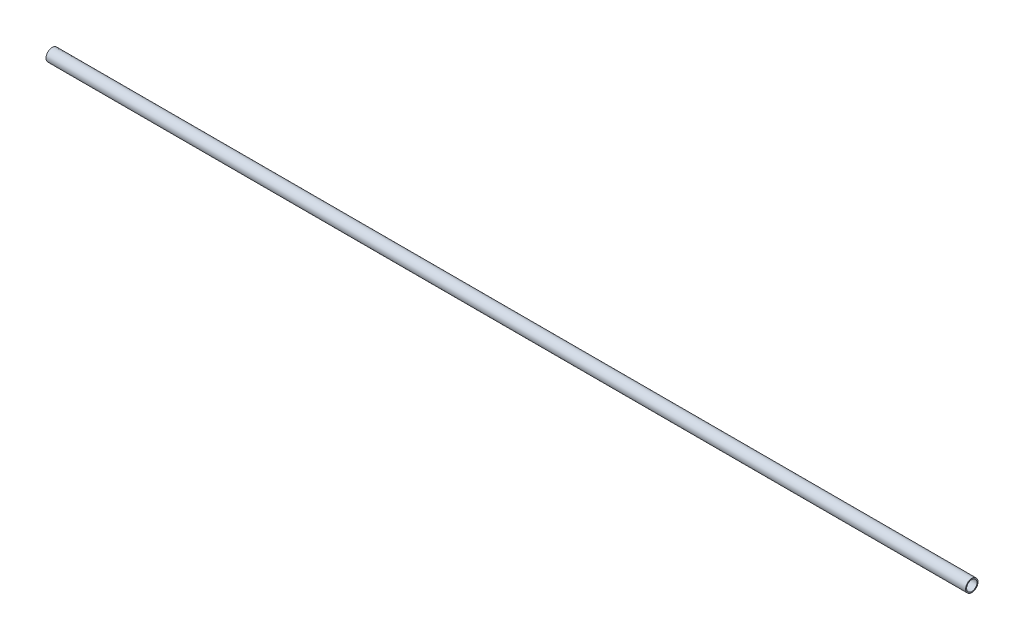
ISO-10303-21;
HEADER;
FILE_DESCRIPTION(('STEP AP214'),'2;1');
FILE_NAME('part.step','',(''),(''),'','','');
FILE_SCHEMA(('AUTOMOTIVE_DESIGN { 1 0 10303 214 1 1 1 1 }'));
ENDSEC;
DATA;
#1=APPLICATION_CONTEXT('core data for automotive mechanical design processes');
#2=APPLICATION_PROTOCOL_DEFINITION('international standard','automotive_design',2000,#1);
#3=PRODUCT_CONTEXT('',#1,'mechanical');
#4=PRODUCT('Part','Part','',(#3));
#5=PRODUCT_RELATED_PRODUCT_CATEGORY('part','',(#4));
#6=PRODUCT_DEFINITION_FORMATION('','',#4);
#7=PRODUCT_DEFINITION_CONTEXT('part definition',#1,'design');
#8=PRODUCT_DEFINITION('design','',#6,#7);
#9=PRODUCT_DEFINITION_SHAPE('','',#8);
#10=(LENGTH_UNIT() NAMED_UNIT(*) SI_UNIT(.MILLI.,.METRE.));
#11=(NAMED_UNIT(*) PLANE_ANGLE_UNIT() SI_UNIT($,.RADIAN.));
#12=(NAMED_UNIT(*) SI_UNIT($,.STERADIAN.) SOLID_ANGLE_UNIT());
#13=UNCERTAINTY_MEASURE_WITH_UNIT(LENGTH_MEASURE(1.E-05),#10,'distance_accuracy_value','');
#14=(GEOMETRIC_REPRESENTATION_CONTEXT(3) GLOBAL_UNCERTAINTY_ASSIGNED_CONTEXT((#13)) GLOBAL_UNIT_ASSIGNED_CONTEXT((#10,
#11,#12)) REPRESENTATION_CONTEXT('',''));
#15=CARTESIAN_POINT('',(0.,0.,0.));
#16=DIRECTION('',(0.,0.,1.));
#17=DIRECTION('',(1.,0.,0.));
#18=AXIS2_PLACEMENT_3D('',#15,#16,#17);
#19=CARTESIAN_POINT('',(-472.313,0.,0.));
#20=DIRECTION('',(1.,0.,0.));
#21=DIRECTION('',(0.,0.,-1.));
#22=AXIS2_PLACEMENT_3D('',#19,#20,#21);
#23=CYLINDRICAL_SURFACE('',#22,3.175);
#24=CARTESIAN_POINT('',(-472.313,0.,0.));
#25=DIRECTION('',(1.,0.,0.));
#26=DIRECTION('',(0.,0.,-1.));
#27=AXIS2_PLACEMENT_3D('',#24,#25,#26);
#28=CIRCLE('',#27,3.175);
#29=CARTESIAN_POINT('',(-472.313,0.,-3.175));
#30=VERTEX_POINT('',#29);
#31=EDGE_CURVE('E10',#30,#30,#28,.T.);
#32=ORIENTED_EDGE('',*,*,#31,.T.);
#33=EDGE_LOOP('',(#32));
#34=FACE_BOUND('',#33,.T.);
#35=CARTESIAN_POINT('',(0.,0.,0.));
#36=DIRECTION('',(1.,0.,0.));
#37=DIRECTION('',(0.,0.,-1.));
#38=AXIS2_PLACEMENT_3D('',#35,#36,#37);
#39=CIRCLE('',#38,3.175);
#40=CARTESIAN_POINT('',(0.,0.,-3.175));
#41=VERTEX_POINT('',#40);
#42=EDGE_CURVE('E46',#41,#41,#39,.T.);
#43=ORIENTED_EDGE('',*,*,#42,.F.);
#44=EDGE_LOOP('',(#43));
#45=FACE_BOUND('',#44,.T.);
#46=ADVANCED_FACE('F43',(#34,#45),#23,.T.);
#47=CARTESIAN_POINT('',(-472.313,0.,0.));
#48=DIRECTION('',(1.,0.,0.));
#49=DIRECTION('',(0.,0.,-1.));
#50=AXIS2_PLACEMENT_3D('',#47,#48,#49);
#51=PLANE('',#50);
#52=CARTESIAN_POINT('',(-472.313,0.,0.));
#53=DIRECTION('',(1.,0.,0.));
#54=DIRECTION('',(0.,0.,-1.));
#55=AXIS2_PLACEMENT_3D('',#52,#53,#54);
#56=CIRCLE('',#55,2.667);
#57=CARTESIAN_POINT('',(-472.313,0.,-2.667));
#58=VERTEX_POINT('',#57);
#59=EDGE_CURVE('E53',#58,#58,#56,.T.);
#60=ORIENTED_EDGE('',*,*,#59,.T.);
#61=EDGE_LOOP('',(#60));
#62=FACE_BOUND('',#61,.T.);
#63=ORIENTED_EDGE('',*,*,#31,.F.);
#64=EDGE_LOOP('',(#63));
#65=FACE_BOUND('',#64,.T.);
#66=ADVANCED_FACE('F61',(#62,#65),#51,.F.);
#67=CARTESIAN_POINT('',(0.,0.,0.));
#68=DIRECTION('',(1.,0.,0.));
#69=DIRECTION('',(0.,0.,-1.));
#70=AXIS2_PLACEMENT_3D('',#67,#68,#69);
#71=PLANE('',#70);
#72=CARTESIAN_POINT('',(0.,0.,0.));
#73=DIRECTION('',(1.,0.,0.));
#74=DIRECTION('',(0.,0.,-1.));
#75=AXIS2_PLACEMENT_3D('',#72,#73,#74);
#76=CIRCLE('',#75,2.667);
#77=CARTESIAN_POINT('',(0.,0.,-2.667));
#78=VERTEX_POINT('',#77);
#79=EDGE_CURVE('E55',#78,#78,#76,.T.);
#80=ORIENTED_EDGE('',*,*,#79,.F.);
#81=EDGE_LOOP('',(#80));
#82=FACE_BOUND('',#81,.T.);
#83=ORIENTED_EDGE('',*,*,#42,.T.);
#84=EDGE_LOOP('',(#83));
#85=FACE_BOUND('',#84,.T.);
#86=ADVANCED_FACE('F67',(#82,#85),#71,.T.);
#87=CARTESIAN_POINT('',(-472.313,0.,0.));
#88=DIRECTION('',(1.,0.,0.));
#89=DIRECTION('',(0.,0.,-1.));
#90=AXIS2_PLACEMENT_3D('',#87,#88,#89);
#91=CYLINDRICAL_SURFACE('',#90,2.667);
#92=ORIENTED_EDGE('',*,*,#59,.F.);
#93=EDGE_LOOP('',(#92));
#94=FACE_BOUND('',#93,.T.);
#95=ORIENTED_EDGE('',*,*,#79,.T.);
#96=EDGE_LOOP('',(#95));
#97=FACE_BOUND('',#96,.T.);
#98=ADVANCED_FACE('F64',(#94,#97),#91,.F.);
#99=CLOSED_SHELL('',(#46,#66,#86,#98));
#100=MANIFOLD_SOLID_BREP('B2',#99);
#101=ADVANCED_BREP_SHAPE_REPRESENTATION('',(#18,#100),#14);
#102=SHAPE_DEFINITION_REPRESENTATION(#9,#101);
ENDSEC;
END-ISO-10303-21;
